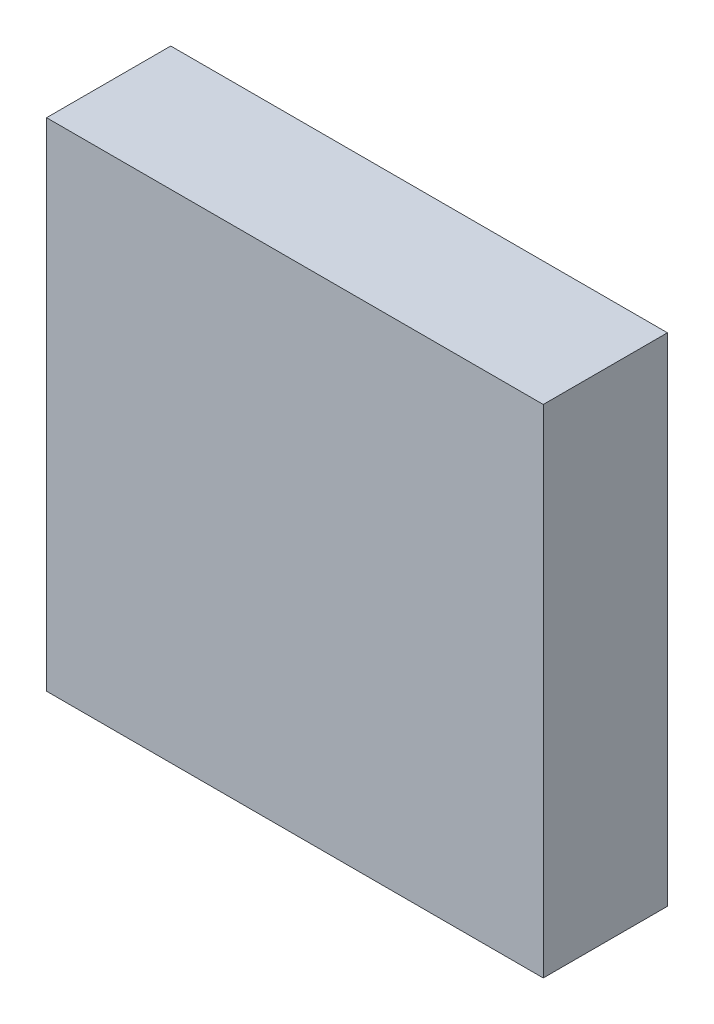
ISO-10303-21;
HEADER;
FILE_DESCRIPTION(('STEP AP214'),'2;1');
FILE_NAME('part.step','',(''),(''),'','','');
FILE_SCHEMA(('AUTOMOTIVE_DESIGN { 1 0 10303 214 1 1 1 1 }'));
ENDSEC;
DATA;
#1=APPLICATION_CONTEXT('core data for automotive mechanical design processes');
#2=APPLICATION_PROTOCOL_DEFINITION('international standard','automotive_design',2000,#1);
#3=PRODUCT_CONTEXT('',#1,'mechanical');
#4=PRODUCT('Part','Part','',(#3));
#5=PRODUCT_RELATED_PRODUCT_CATEGORY('part','',(#4));
#6=PRODUCT_DEFINITION_FORMATION('','',#4);
#7=PRODUCT_DEFINITION_CONTEXT('part definition',#1,'design');
#8=PRODUCT_DEFINITION('design','',#6,#7);
#9=PRODUCT_DEFINITION_SHAPE('','',#8);
#10=(LENGTH_UNIT() NAMED_UNIT(*) SI_UNIT(.MILLI.,.METRE.));
#11=(NAMED_UNIT(*) PLANE_ANGLE_UNIT() SI_UNIT($,.RADIAN.));
#12=(NAMED_UNIT(*) SI_UNIT($,.STERADIAN.) SOLID_ANGLE_UNIT());
#13=UNCERTAINTY_MEASURE_WITH_UNIT(LENGTH_MEASURE(1.E-05),#10,'distance_accuracy_value','');
#14=(GEOMETRIC_REPRESENTATION_CONTEXT(3) GLOBAL_UNCERTAINTY_ASSIGNED_CONTEXT((#13)) GLOBAL_UNIT_ASSIGNED_CONTEXT((#10,
#11,#12)) REPRESENTATION_CONTEXT('',''));
#15=CARTESIAN_POINT('',(0.,0.,0.));
#16=DIRECTION('',(0.,0.,1.));
#17=DIRECTION('',(1.,0.,0.));
#18=AXIS2_PLACEMENT_3D('',#15,#16,#17);
#19=CARTESIAN_POINT('',(-0.4,0.4,0.));
#20=DIRECTION('',(0.,0.,1.));
#21=DIRECTION('',(1.,0.,0.));
#22=AXIS2_PLACEMENT_3D('',#19,#20,#21);
#23=PLANE('',#22);
#24=DIRECTION('',(0.,1.,0.));
#25=VECTOR('',#24,1.);
#26=CARTESIAN_POINT('',(0.4,0.4,0.));
#27=LINE('',#26,#25);
#28=CARTESIAN_POINT('',(0.4,-0.4,0.));
#29=VERTEX_POINT('',#28);
#30=CARTESIAN_POINT('',(0.4,0.4,0.));
#31=VERTEX_POINT('',#30);
#32=EDGE_CURVE('E11',#29,#31,#27,.T.);
#33=ORIENTED_EDGE('',*,*,#32,.F.);
#34=DIRECTION('',(1.,0.,0.));
#35=VECTOR('',#34,1.);
#36=CARTESIAN_POINT('',(-0.4,-0.4,0.));
#37=LINE('',#36,#35);
#38=CARTESIAN_POINT('',(-0.4,-0.4,0.));
#39=VERTEX_POINT('',#38);
#40=EDGE_CURVE('E25',#39,#29,#37,.T.);
#41=ORIENTED_EDGE('',*,*,#40,.F.);
#42=DIRECTION('',(0.,-1.,0.));
#43=VECTOR('',#42,1.);
#44=CARTESIAN_POINT('',(-0.4,0.4,0.));
#45=LINE('',#44,#43);
#46=CARTESIAN_POINT('',(-0.4,0.4,0.));
#47=VERTEX_POINT('',#46);
#48=EDGE_CURVE('E95',#47,#39,#45,.T.);
#49=ORIENTED_EDGE('',*,*,#48,.F.);
#50=DIRECTION('',(-1.,0.,0.));
#51=VECTOR('',#50,1.);
#52=CARTESIAN_POINT('',(-0.4,0.4,0.));
#53=LINE('',#52,#51);
#54=EDGE_CURVE('E90',#31,#47,#53,.T.);
#55=ORIENTED_EDGE('',*,*,#54,.F.);
#56=EDGE_LOOP('',(#33,#41,#49,#55));
#57=FACE_BOUND('',#56,.T.);
#58=ADVANCED_FACE('F17',(#57),#23,.F.);
#59=CARTESIAN_POINT('',(-0.4,0.4,0.));
#60=DIRECTION('',(0.,1.,0.));
#61=DIRECTION('',(0.,0.,1.));
#62=AXIS2_PLACEMENT_3D('',#59,#60,#61);
#63=PLANE('',#62);
#64=DIRECTION('',(0.,0.,-1.));
#65=VECTOR('',#64,1.);
#66=CARTESIAN_POINT('',(0.4,0.4,0.));
#67=LINE('',#66,#65);
#68=CARTESIAN_POINT('',(0.4,0.4,0.2));
#69=VERTEX_POINT('',#68);
#70=EDGE_CURVE('E73',#69,#31,#67,.T.);
#71=ORIENTED_EDGE('',*,*,#70,.T.);
#72=ORIENTED_EDGE('',*,*,#54,.T.);
#73=DIRECTION('',(0.,0.,1.));
#74=VECTOR('',#73,1.);
#75=CARTESIAN_POINT('',(-0.4,0.4,0.));
#76=LINE('',#75,#74);
#77=CARTESIAN_POINT('',(-0.4,0.4,0.2));
#78=VERTEX_POINT('',#77);
#79=EDGE_CURVE('E76',#47,#78,#76,.T.);
#80=ORIENTED_EDGE('',*,*,#79,.T.);
#81=DIRECTION('',(1.,0.,0.));
#82=VECTOR('',#81,1.);
#83=CARTESIAN_POINT('',(-0.4,0.4,0.2));
#84=LINE('',#83,#82);
#85=EDGE_CURVE('E74',#78,#69,#84,.T.);
#86=ORIENTED_EDGE('',*,*,#85,.T.);
#87=EDGE_LOOP('',(#71,#72,#80,#86));
#88=FACE_BOUND('',#87,.T.);
#89=ADVANCED_FACE('F108',(#88),#63,.T.);
#90=CARTESIAN_POINT('',(-0.4,0.4,0.2));
#91=DIRECTION('',(0.,0.,1.));
#92=DIRECTION('',(1.,0.,0.));
#93=AXIS2_PLACEMENT_3D('',#90,#91,#92);
#94=PLANE('',#93);
#95=DIRECTION('',(0.,-1.,0.));
#96=VECTOR('',#95,1.);
#97=CARTESIAN_POINT('',(0.4,0.4,0.2));
#98=LINE('',#97,#96);
#99=CARTESIAN_POINT('',(0.4,-0.4,0.2));
#100=VERTEX_POINT('',#99);
#101=EDGE_CURVE('E59',#69,#100,#98,.T.);
#102=ORIENTED_EDGE('',*,*,#101,.F.);
#103=ORIENTED_EDGE('',*,*,#85,.F.);
#104=DIRECTION('',(0.,1.,0.));
#105=VECTOR('',#104,1.);
#106=CARTESIAN_POINT('',(-0.4,-0.4,0.2));
#107=LINE('',#106,#105);
#108=CARTESIAN_POINT('',(-0.4,-0.4,0.2));
#109=VERTEX_POINT('',#108);
#110=EDGE_CURVE('E62',#109,#78,#107,.T.);
#111=ORIENTED_EDGE('',*,*,#110,.F.);
#112=DIRECTION('',(-1.,0.,0.));
#113=VECTOR('',#112,1.);
#114=CARTESIAN_POINT('',(0.4,-0.4,0.2));
#115=LINE('',#114,#113);
#116=EDGE_CURVE('E54',#100,#109,#115,.T.);
#117=ORIENTED_EDGE('',*,*,#116,.F.);
#118=EDGE_LOOP('',(#102,#103,#111,#117));
#119=FACE_BOUND('',#118,.T.);
#120=ADVANCED_FACE('F56',(#119),#94,.T.);
#121=CARTESIAN_POINT('',(0.4,-0.4,0.));
#122=DIRECTION('',(0.,-1.,0.));
#123=DIRECTION('',(0.,0.,-1.));
#124=AXIS2_PLACEMENT_3D('',#121,#122,#123);
#125=PLANE('',#124);
#126=DIRECTION('',(0.,0.,-1.));
#127=VECTOR('',#126,1.);
#128=CARTESIAN_POINT('',(-0.4,-0.4,0.));
#129=LINE('',#128,#127);
#130=EDGE_CURVE('E65',#109,#39,#129,.T.);
#131=ORIENTED_EDGE('',*,*,#130,.T.);
#132=ORIENTED_EDGE('',*,*,#40,.T.);
#133=DIRECTION('',(0.,0.,-1.));
#134=VECTOR('',#133,1.);
#135=CARTESIAN_POINT('',(0.4,-0.4,0.));
#136=LINE('',#135,#134);
#137=EDGE_CURVE('E67',#100,#29,#136,.T.);
#138=ORIENTED_EDGE('',*,*,#137,.F.);
#139=ORIENTED_EDGE('',*,*,#116,.T.);
#140=EDGE_LOOP('',(#131,#132,#138,#139));
#141=FACE_BOUND('',#140,.T.);
#142=ADVANCED_FACE('F68',(#141),#125,.T.);
#143=CARTESIAN_POINT('',(0.4,0.4,0.));
#144=DIRECTION('',(1.,0.,0.));
#145=DIRECTION('',(0.,0.,-1.));
#146=AXIS2_PLACEMENT_3D('',#143,#144,#145);
#147=PLANE('',#146);
#148=ORIENTED_EDGE('',*,*,#137,.T.);
#149=ORIENTED_EDGE('',*,*,#32,.T.);
#150=ORIENTED_EDGE('',*,*,#70,.F.);
#151=ORIENTED_EDGE('',*,*,#101,.T.);
#152=EDGE_LOOP('',(#148,#149,#150,#151));
#153=FACE_BOUND('',#152,.T.);
#154=ADVANCED_FACE('F71',(#153),#147,.T.);
#155=CARTESIAN_POINT('',(-0.4,-0.4,0.));
#156=DIRECTION('',(-1.,0.,0.));
#157=DIRECTION('',(0.,0.,1.));
#158=AXIS2_PLACEMENT_3D('',#155,#156,#157);
#159=PLANE('',#158);
#160=ORIENTED_EDGE('',*,*,#79,.F.);
#161=ORIENTED_EDGE('',*,*,#48,.T.);
#162=ORIENTED_EDGE('',*,*,#130,.F.);
#163=ORIENTED_EDGE('',*,*,#110,.T.);
#164=EDGE_LOOP('',(#160,#161,#162,#163));
#165=FACE_BOUND('',#164,.T.);
#166=ADVANCED_FACE('F106',(#165),#159,.T.);
#167=CLOSED_SHELL('',(#58,#89,#120,#142,#154,#166));
#168=MANIFOLD_SOLID_BREP('B1',#167);
#169=ADVANCED_BREP_SHAPE_REPRESENTATION('',(#18,#168),#14);
#170=SHAPE_DEFINITION_REPRESENTATION(#9,#169);
ENDSEC;
END-ISO-10303-21;
